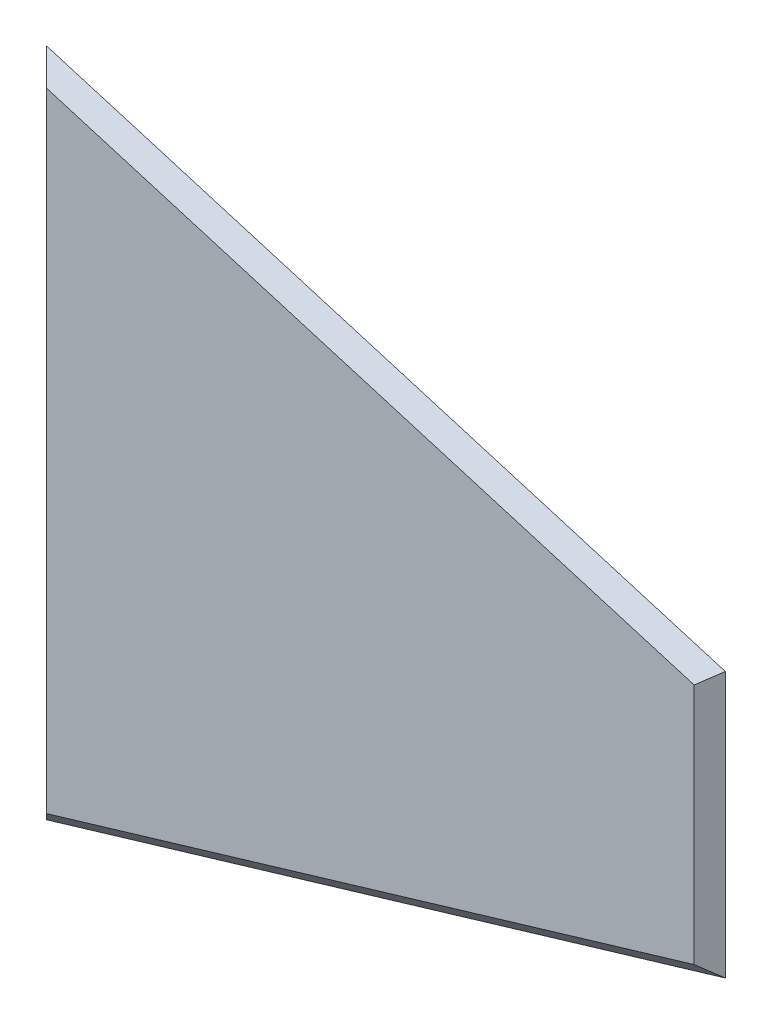
ISO-10303-21;
HEADER;
FILE_DESCRIPTION(('STEP AP214'),'2;1');
FILE_NAME('part.step','',(''),(''),'','','');
FILE_SCHEMA(('AUTOMOTIVE_DESIGN { 1 0 10303 214 1 1 1 1 }'));
ENDSEC;
DATA;
#1=APPLICATION_CONTEXT('core data for automotive mechanical design processes');
#2=APPLICATION_PROTOCOL_DEFINITION('international standard','automotive_design',2000,#1);
#3=PRODUCT_CONTEXT('',#1,'mechanical');
#4=PRODUCT('Part','Part','',(#3));
#5=PRODUCT_RELATED_PRODUCT_CATEGORY('part','',(#4));
#6=PRODUCT_DEFINITION_FORMATION('','',#4);
#7=PRODUCT_DEFINITION_CONTEXT('part definition',#1,'design');
#8=PRODUCT_DEFINITION('design','',#6,#7);
#9=PRODUCT_DEFINITION_SHAPE('','',#8);
#10=(LENGTH_UNIT() NAMED_UNIT(*) SI_UNIT(.MILLI.,.METRE.));
#11=(NAMED_UNIT(*) PLANE_ANGLE_UNIT() SI_UNIT($,.RADIAN.));
#12=(NAMED_UNIT(*) SI_UNIT($,.STERADIAN.) SOLID_ANGLE_UNIT());
#13=UNCERTAINTY_MEASURE_WITH_UNIT(LENGTH_MEASURE(1.E-05),#10,'distance_accuracy_value','');
#14=(GEOMETRIC_REPRESENTATION_CONTEXT(3) GLOBAL_UNCERTAINTY_ASSIGNED_CONTEXT((#13)) GLOBAL_UNIT_ASSIGNED_CONTEXT((#10,
#11,#12)) REPRESENTATION_CONTEXT('',''));
#15=CARTESIAN_POINT('',(0.,0.,0.));
#16=DIRECTION('',(0.,0.,1.));
#17=DIRECTION('',(1.,0.,0.));
#18=AXIS2_PLACEMENT_3D('',#15,#16,#17);
#19=CARTESIAN_POINT('',(0.,0.,10.));
#20=DIRECTION('',(0.,0.,-1.));
#21=DIRECTION('',(-1.,0.,0.));
#22=AXIS2_PLACEMENT_3D('',#19,#20,#21);
#23=PLANE('',#22);
#24=DIRECTION('',(-0.95831893820855,0.285700564701641,0.));
#25=VECTOR('',#24,1.);
#26=CARTESIAN_POINT('',(20.4153366068727,68.4787015408934,10.));
#27=LINE('',#26,#25);
#28=CARTESIAN_POINT('',(-10.,77.5463287135529,10.));
#29=VERTEX_POINT('',#28);
#30=CARTESIAN_POINT('',(-424.714346895075,201.183792582613,10.));
#31=VERTEX_POINT('',#30);
#32=EDGE_CURVE('E42',#29,#31,#27,.T.);
#33=ORIENTED_EDGE('',*,*,#32,.T.);
#34=DIRECTION('',(0.,-1.,0.));
#35=VECTOR('',#34,1.);
#36=CARTESIAN_POINT('',(-424.714346895075,0.,10.));
#37=LINE('',#36,#35);
#38=CARTESIAN_POINT('',(-424.714346895075,-201.183792582613,10.));
#39=VERTEX_POINT('',#38);
#40=EDGE_CURVE('E11',#31,#39,#37,.T.);
#41=ORIENTED_EDGE('',*,*,#40,.T.);
#42=DIRECTION('',(0.95831893820855,0.285700564701641,0.));
#43=VECTOR('',#42,1.);
#44=CARTESIAN_POINT('',(20.4153366068727,-68.4787015408934,10.));
#45=LINE('',#44,#43);
#46=CARTESIAN_POINT('',(-10.,-77.5463287135529,10.));
#47=VERTEX_POINT('',#46);
#48=EDGE_CURVE('E98',#39,#47,#45,.T.);
#49=ORIENTED_EDGE('',*,*,#48,.T.);
#50=DIRECTION('',(0.,1.,0.));
#51=VECTOR('',#50,1.);
#52=CARTESIAN_POINT('',(-10.,0.,10.));
#53=LINE('',#52,#51);
#54=EDGE_CURVE('E53',#47,#29,#53,.T.);
#55=ORIENTED_EDGE('',*,*,#54,.T.);
#56=EDGE_LOOP('',(#33,#41,#49,#55));
#57=FACE_BOUND('',#56,.T.);
#58=ADVANCED_FACE('F33',(#57),#23,.F.);
#59=CARTESIAN_POINT('',(0.,0.,0.));
#60=DIRECTION('',(0.,0.,-1.));
#61=DIRECTION('',(-1.,0.,0.));
#62=AXIS2_PLACEMENT_3D('',#59,#60,#61);
#63=PLANE('',#62);
#64=DIRECTION('',(-0.95831893820855,0.285700564701641,0.));
#65=VECTOR('',#64,1.);
#66=CARTESIAN_POINT('',(-434.714346895075,214.6,0.));
#67=LINE('',#66,#65);
#68=CARTESIAN_POINT('',(0.,85.,0.));
#69=VERTEX_POINT('',#68);
#70=CARTESIAN_POINT('',(-434.714346895075,214.6,0.));
#71=VERTEX_POINT('',#70);
#72=EDGE_CURVE('E85',#69,#71,#67,.T.);
#73=ORIENTED_EDGE('',*,*,#72,.F.);
#74=DIRECTION('',(0.,1.,0.));
#75=VECTOR('',#74,1.);
#76=CARTESIAN_POINT('',(0.,85.,0.));
#77=LINE('',#76,#75);
#78=CARTESIAN_POINT('',(0.,-85.,0.));
#79=VERTEX_POINT('',#78);
#80=EDGE_CURVE('E94',#79,#69,#77,.T.);
#81=ORIENTED_EDGE('',*,*,#80,.F.);
#82=DIRECTION('',(0.95831893820855,0.285700564701641,0.));
#83=VECTOR('',#82,1.);
#84=CARTESIAN_POINT('',(-434.714346895075,-214.6,0.));
#85=LINE('',#84,#83);
#86=CARTESIAN_POINT('',(-434.714346895075,-214.6,0.));
#87=VERTEX_POINT('',#86);
#88=EDGE_CURVE('E92',#87,#79,#85,.T.);
#89=ORIENTED_EDGE('',*,*,#88,.F.);
#90=DIRECTION('',(0.,-1.,0.));
#91=VECTOR('',#90,1.);
#92=CARTESIAN_POINT('',(-434.714346895075,-214.6,0.));
#93=LINE('',#92,#91);
#94=EDGE_CURVE('E78',#71,#87,#93,.T.);
#95=ORIENTED_EDGE('',*,*,#94,.F.);
#96=EDGE_LOOP('',(#73,#81,#89,#95));
#97=FACE_BOUND('',#96,.T.);
#98=ADVANCED_FACE('F90',(#97),#63,.T.);
#99=CARTESIAN_POINT('',(-10.,0.,10.));
#100=DIRECTION('',(-0.707106781186549,0.,-0.707106781186546));
#101=DIRECTION('',(0.,1.,0.));
#102=AXIS2_PLACEMENT_3D('',#99,#100,#101);
#103=PLANE('',#102);
#104=DIRECTION('',(-0.62554121041427,0.466257855855422,0.625541210414274));
#105=VECTOR('',#104,1.);
#106=CARTESIAN_POINT('',(-0.743119767630279,-84.4461029525623,0.743119767630218));
#107=LINE('',#106,#105);
#108=EDGE_CURVE('E81',#79,#47,#107,.T.);
#109=ORIENTED_EDGE('',*,*,#108,.F.);
#110=ORIENTED_EDGE('',*,*,#80,.T.);
#111=DIRECTION('',(-0.62554121041427,-0.466257855855422,0.625541210414273));
#112=VECTOR('',#111,1.);
#113=CARTESIAN_POINT('',(-32.6174339174729,60.6880369371746,32.617433917473));
#114=LINE('',#113,#112);
#115=EDGE_CURVE('E37',#29,#69,#114,.F.);
#116=ORIENTED_EDGE('',*,*,#115,.F.);
#117=ORIENTED_EDGE('',*,*,#54,.F.);
#118=EDGE_LOOP('',(#109,#110,#116,#117));
#119=FACE_BOUND('',#118,.T.);
#120=ADVANCED_FACE('F35',(#119),#103,.F.);
#121=CARTESIAN_POINT('',(20.4153366068727,68.4787015408934,10.));
#122=DIRECTION('',(-0.202020806689357,-0.677633819746761,-0.707106781186544));
#123=DIRECTION('',(-0.95831893820855,0.285700564701641,0.));
#124=AXIS2_PLACEMENT_3D('',#121,#122,#123);
#125=PLANE('',#124);
#126=ORIENTED_EDGE('',*,*,#115,.T.);
#127=ORIENTED_EDGE('',*,*,#72,.T.);
#128=DIRECTION('',(0.512992806514721,-0.688241789582918,0.512992806514723));
#129=VECTOR('',#128,1.);
#130=CARTESIAN_POINT('',(-260.720029351028,-18.8343853617707,173.994317544048));
#131=LINE('',#130,#129);
#132=EDGE_CURVE('E74',#31,#71,#131,.F.);
#133=ORIENTED_EDGE('',*,*,#132,.F.);
#134=ORIENTED_EDGE('',*,*,#32,.F.);
#135=EDGE_LOOP('',(#126,#127,#133,#134));
#136=FACE_BOUND('',#135,.T.);
#137=ADVANCED_FACE('F86',(#136),#125,.F.);
#138=CARTESIAN_POINT('',(20.4153366068727,-68.4787015408934,10.));
#139=DIRECTION('',(-0.202020806689357,0.677633819746761,-0.707106781186544));
#140=DIRECTION('',(0.95831893820855,0.285700564701641,0.));
#141=AXIS2_PLACEMENT_3D('',#138,#139,#140);
#142=PLANE('',#141);
#143=ORIENTED_EDGE('',*,*,#108,.T.);
#144=ORIENTED_EDGE('',*,*,#48,.F.);
#145=DIRECTION('',(-0.512992806514721,-0.688241789582918,-0.512992806514723));
#146=VECTOR('',#145,1.);
#147=CARTESIAN_POINT('',(-260.720029351028,18.8343853617707,173.994317544048));
#148=LINE('',#147,#146);
#149=EDGE_CURVE('E82',#87,#39,#148,.F.);
#150=ORIENTED_EDGE('',*,*,#149,.F.);
#151=ORIENTED_EDGE('',*,*,#88,.T.);
#152=EDGE_LOOP('',(#143,#144,#150,#151));
#153=FACE_BOUND('',#152,.T.);
#154=ADVANCED_FACE('F106',(#153),#142,.F.);
#155=CARTESIAN_POINT('',(-424.714346895075,0.,10.));
#156=DIRECTION('',(0.707106781186549,0.,-0.707106781186545));
#157=DIRECTION('',(0.,-1.,0.));
#158=AXIS2_PLACEMENT_3D('',#155,#156,#157);
#159=PLANE('',#158);
#160=ORIENTED_EDGE('',*,*,#132,.T.);
#161=ORIENTED_EDGE('',*,*,#94,.T.);
#162=ORIENTED_EDGE('',*,*,#149,.T.);
#163=ORIENTED_EDGE('',*,*,#40,.F.);
#164=EDGE_LOOP('',(#160,#161,#162,#163));
#165=FACE_BOUND('',#164,.T.);
#166=ADVANCED_FACE('F76',(#165),#159,.F.);
#167=CLOSED_SHELL('',(#58,#98,#120,#137,#154,#166));
#168=MANIFOLD_SOLID_BREP('B2',#167);
#169=ADVANCED_BREP_SHAPE_REPRESENTATION('',(#18,#168),#14);
#170=SHAPE_DEFINITION_REPRESENTATION(#9,#169);
ENDSEC;
END-ISO-10303-21;
